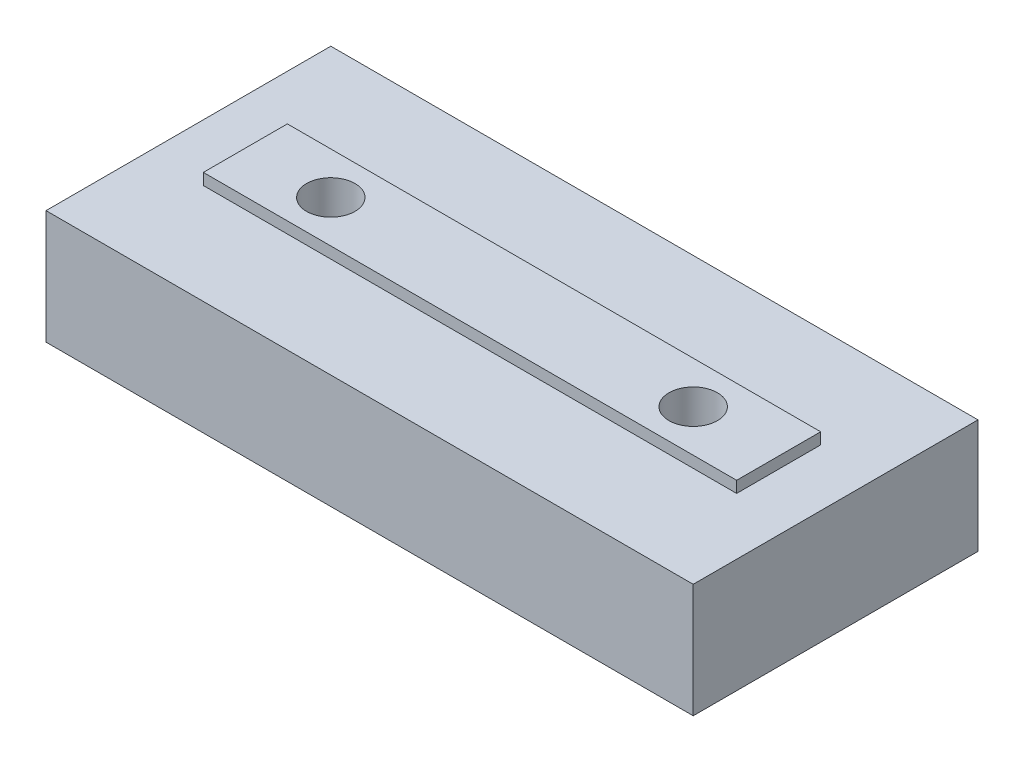
ISO-10303-21;
HEADER;
FILE_DESCRIPTION(('STEP AP214'),'2;1');
FILE_NAME('part.step','',(''),(''),'','','');
FILE_SCHEMA(('AUTOMOTIVE_DESIGN { 1 0 10303 214 1 1 1 1 }'));
ENDSEC;
DATA;
#1=APPLICATION_CONTEXT('core data for automotive mechanical design processes');
#2=APPLICATION_PROTOCOL_DEFINITION('international standard','automotive_design',2000,#1);
#3=PRODUCT_CONTEXT('',#1,'mechanical');
#4=PRODUCT('Part','Part','',(#3));
#5=PRODUCT_RELATED_PRODUCT_CATEGORY('part','',(#4));
#6=PRODUCT_DEFINITION_FORMATION('','',#4);
#7=PRODUCT_DEFINITION_CONTEXT('part definition',#1,'design');
#8=PRODUCT_DEFINITION('design','',#6,#7);
#9=PRODUCT_DEFINITION_SHAPE('','',#8);
#10=(LENGTH_UNIT() NAMED_UNIT(*) SI_UNIT(.MILLI.,.METRE.));
#11=(NAMED_UNIT(*) PLANE_ANGLE_UNIT() SI_UNIT($,.RADIAN.));
#12=(NAMED_UNIT(*) SI_UNIT($,.STERADIAN.) SOLID_ANGLE_UNIT());
#13=UNCERTAINTY_MEASURE_WITH_UNIT(LENGTH_MEASURE(1.E-05),#10,'distance_accuracy_value','');
#14=(GEOMETRIC_REPRESENTATION_CONTEXT(3) GLOBAL_UNCERTAINTY_ASSIGNED_CONTEXT((#13)) GLOBAL_UNIT_ASSIGNED_CONTEXT((#10,
#11,#12)) REPRESENTATION_CONTEXT('',''));
#15=CARTESIAN_POINT('',(0.,0.,0.));
#16=DIRECTION('',(0.,0.,1.));
#17=DIRECTION('',(1.,0.,0.));
#18=AXIS2_PLACEMENT_3D('',#15,#16,#17);
#19=CARTESIAN_POINT('',(-15.0702343832528,8.,-8.07629807039338));
#20=DIRECTION('',(1.,0.,0.));
#21=DIRECTION('',(0.,0.,-1.));
#22=AXIS2_PLACEMENT_3D('',#19,#20,#21);
#23=PLANE('',#22);
#24=DIRECTION('',(0.,0.,1.));
#25=VECTOR('',#24,1.);
#26=CARTESIAN_POINT('',(-15.0702343832528,0.,-8.07629807039338));
#27=LINE('',#26,#25);
#28=CARTESIAN_POINT('',(-15.0702343832528,0.,-8.07629807039338));
#29=VERTEX_POINT('',#28);
#30=CARTESIAN_POINT('',(-15.0702343832528,0.,11.9237019296066));
#31=VERTEX_POINT('',#30);
#32=EDGE_CURVE('E121',#29,#31,#27,.T.);
#33=ORIENTED_EDGE('',*,*,#32,.T.);
#34=DIRECTION('',(0.,-1.,0.));
#35=VECTOR('',#34,1.);
#36=CARTESIAN_POINT('',(-15.0702343832528,8.,11.9237019296066));
#37=LINE('',#36,#35);
#38=CARTESIAN_POINT('',(-15.0702343832528,8.,11.9237019296066));
#39=VERTEX_POINT('',#38);
#40=EDGE_CURVE('E11',#39,#31,#37,.T.);
#41=ORIENTED_EDGE('',*,*,#40,.F.);
#42=DIRECTION('',(0.,0.,1.));
#43=VECTOR('',#42,1.);
#44=CARTESIAN_POINT('',(-15.0702343832528,8.,-8.07629807039338));
#45=LINE('',#44,#43);
#46=CARTESIAN_POINT('',(-15.0702343832528,8.,-8.07629807039338));
#47=VERTEX_POINT('',#46);
#48=EDGE_CURVE('E130',#47,#39,#45,.T.);
#49=ORIENTED_EDGE('',*,*,#48,.F.);
#50=DIRECTION('',(0.,-1.,0.));
#51=VECTOR('',#50,1.);
#52=CARTESIAN_POINT('',(-15.0702343832528,8.,-8.07629807039338));
#53=LINE('',#52,#51);
#54=EDGE_CURVE('E141',#47,#29,#53,.T.);
#55=ORIENTED_EDGE('',*,*,#54,.T.);
#56=EDGE_LOOP('',(#33,#41,#49,#55));
#57=FACE_BOUND('',#56,.T.);
#58=ADVANCED_FACE('F36',(#57),#23,.F.);
#59=CARTESIAN_POINT('',(-15.0702343832528,8.,11.9237019296066));
#60=DIRECTION('',(0.,0.,-1.));
#61=DIRECTION('',(-1.,0.,0.));
#62=AXIS2_PLACEMENT_3D('',#59,#60,#61);
#63=PLANE('',#62);
#64=DIRECTION('',(1.,0.,0.));
#65=VECTOR('',#64,1.);
#66=CARTESIAN_POINT('',(-15.0702343832528,0.,11.9237019296066));
#67=LINE('',#66,#65);
#68=CARTESIAN_POINT('',(30.3797656167472,0.,11.9237019296066));
#69=VERTEX_POINT('',#68);
#70=EDGE_CURVE('E124',#31,#69,#67,.T.);
#71=ORIENTED_EDGE('',*,*,#70,.T.);
#72=DIRECTION('',(0.,-1.,0.));
#73=VECTOR('',#72,1.);
#74=CARTESIAN_POINT('',(30.3797656167472,8.,11.9237019296066));
#75=LINE('',#74,#73);
#76=CARTESIAN_POINT('',(30.3797656167472,8.,11.9237019296066));
#77=VERTEX_POINT('',#76);
#78=EDGE_CURVE('E43',#77,#69,#75,.T.);
#79=ORIENTED_EDGE('',*,*,#78,.F.);
#80=DIRECTION('',(1.,0.,0.));
#81=VECTOR('',#80,1.);
#82=CARTESIAN_POINT('',(-15.0702343832528,8.,11.9237019296066));
#83=LINE('',#82,#81);
#84=EDGE_CURVE('E133',#39,#77,#83,.T.);
#85=ORIENTED_EDGE('',*,*,#84,.F.);
#86=ORIENTED_EDGE('',*,*,#40,.T.);
#87=EDGE_LOOP('',(#71,#79,#85,#86));
#88=FACE_BOUND('',#87,.T.);
#89=ADVANCED_FACE('F158',(#88),#63,.F.);
#90=CARTESIAN_POINT('',(30.3797656167472,8.,-8.07629807039338));
#91=DIRECTION('',(1.,0.,0.));
#92=DIRECTION('',(0.,0.,-1.));
#93=AXIS2_PLACEMENT_3D('',#90,#91,#92);
#94=PLANE('',#93);
#95=DIRECTION('',(0.,0.,1.));
#96=VECTOR('',#95,1.);
#97=CARTESIAN_POINT('',(30.3797656167472,0.,-8.07629807039338));
#98=LINE('',#97,#96);
#99=CARTESIAN_POINT('',(30.3797656167472,0.,-8.07629807039338));
#100=VERTEX_POINT('',#99);
#101=EDGE_CURVE('E145',#100,#69,#98,.T.);
#102=ORIENTED_EDGE('',*,*,#101,.F.);
#103=DIRECTION('',(0.,-1.,0.));
#104=VECTOR('',#103,1.);
#105=CARTESIAN_POINT('',(30.3797656167472,8.,-8.07629807039338));
#106=LINE('',#105,#104);
#107=CARTESIAN_POINT('',(30.3797656167472,8.,-8.07629807039338));
#108=VERTEX_POINT('',#107);
#109=EDGE_CURVE('E151',#108,#100,#106,.T.);
#110=ORIENTED_EDGE('',*,*,#109,.F.);
#111=DIRECTION('',(0.,0.,1.));
#112=VECTOR('',#111,1.);
#113=CARTESIAN_POINT('',(30.3797656167472,8.,-8.07629807039338));
#114=LINE('',#113,#112);
#115=EDGE_CURVE('E136',#108,#77,#114,.T.);
#116=ORIENTED_EDGE('',*,*,#115,.T.);
#117=ORIENTED_EDGE('',*,*,#78,.T.);
#118=EDGE_LOOP('',(#102,#110,#116,#117));
#119=FACE_BOUND('',#118,.T.);
#120=ADVANCED_FACE('F155',(#119),#94,.T.);
#121=CARTESIAN_POINT('',(-15.0702343832528,8.,-8.07629807039338));
#122=DIRECTION('',(0.,0.,-1.));
#123=DIRECTION('',(-1.,0.,0.));
#124=AXIS2_PLACEMENT_3D('',#121,#122,#123);
#125=PLANE('',#124);
#126=DIRECTION('',(1.,0.,0.));
#127=VECTOR('',#126,1.);
#128=CARTESIAN_POINT('',(-15.0702343832528,0.,-8.07629807039338));
#129=LINE('',#128,#127);
#130=EDGE_CURVE('E134',#29,#100,#129,.T.);
#131=ORIENTED_EDGE('',*,*,#130,.F.);
#132=ORIENTED_EDGE('',*,*,#54,.F.);
#133=DIRECTION('',(1.,0.,0.));
#134=VECTOR('',#133,1.);
#135=CARTESIAN_POINT('',(-15.0702343832528,8.,-8.07629807039338));
#136=LINE('',#135,#134);
#137=EDGE_CURVE('E139',#47,#108,#136,.T.);
#138=ORIENTED_EDGE('',*,*,#137,.T.);
#139=ORIENTED_EDGE('',*,*,#109,.T.);
#140=EDGE_LOOP('',(#131,#132,#138,#139));
#141=FACE_BOUND('',#140,.T.);
#142=ADVANCED_FACE('F165',(#141),#125,.T.);
#143=CARTESIAN_POINT('',(0.,8.,0.));
#144=DIRECTION('',(0.,1.,0.));
#145=DIRECTION('',(0.,0.,1.));
#146=AXIS2_PLACEMENT_3D('',#143,#144,#145);
#147=PLANE('',#146);
#148=DIRECTION('',(0.,0.,1.));
#149=VECTOR('',#148,1.);
#150=CARTESIAN_POINT('',(-11.0702343832528,8.,-1.02629807039336));
#151=LINE('',#150,#149);
#152=CARTESIAN_POINT('',(-11.0702343832528,8.,-1.02629807039336));
#153=VERTEX_POINT('',#152);
#154=CARTESIAN_POINT('',(-11.0702343832528,8.,4.87370192960663));
#155=VERTEX_POINT('',#154);
#156=EDGE_CURVE('E50',#153,#155,#151,.T.);
#157=ORIENTED_EDGE('',*,*,#156,.F.);
#158=DIRECTION('',(1.,0.,0.));
#159=VECTOR('',#158,1.);
#160=CARTESIAN_POINT('',(-11.0702343832528,8.,-1.02629807039336));
#161=LINE('',#160,#159);
#162=CARTESIAN_POINT('',(26.3797656167472,8.,-1.02629807039336));
#163=VERTEX_POINT('',#162);
#164=EDGE_CURVE('E55',#153,#163,#161,.T.);
#165=ORIENTED_EDGE('',*,*,#164,.T.);
#166=DIRECTION('',(0.,0.,1.));
#167=VECTOR('',#166,1.);
#168=CARTESIAN_POINT('',(26.3797656167472,8.,-1.02629807039336));
#169=LINE('',#168,#167);
#170=CARTESIAN_POINT('',(26.3797656167472,8.,4.87370192960663));
#171=VERTEX_POINT('',#170);
#172=EDGE_CURVE('E233',#163,#171,#169,.T.);
#173=ORIENTED_EDGE('',*,*,#172,.T.);
#174=DIRECTION('',(1.,0.,0.));
#175=VECTOR('',#174,1.);
#176=CARTESIAN_POINT('',(-11.0702343832528,8.,4.87370192960663));
#177=LINE('',#176,#175);
#178=EDGE_CURVE('E231',#155,#171,#177,.T.);
#179=ORIENTED_EDGE('',*,*,#178,.F.);
#180=EDGE_LOOP('',(#157,#165,#173,#179));
#181=FACE_BOUND('',#180,.T.);
#182=ORIENTED_EDGE('',*,*,#48,.T.);
#183=ORIENTED_EDGE('',*,*,#84,.T.);
#184=ORIENTED_EDGE('',*,*,#115,.F.);
#185=ORIENTED_EDGE('',*,*,#137,.F.);
#186=EDGE_LOOP('',(#182,#183,#184,#185));
#187=FACE_BOUND('',#186,.T.);
#188=ADVANCED_FACE('F169',(#181,#187),#147,.T.);
#189=CARTESIAN_POINT('',(0.,0.,0.));
#190=DIRECTION('',(0.,1.,0.));
#191=DIRECTION('',(0.,0.,1.));
#192=AXIS2_PLACEMENT_3D('',#189,#190,#191);
#193=PLANE('',#192);
#194=CARTESIAN_POINT('',(20.3797656167472,0.,1.92370192960662));
#195=DIRECTION('',(0.,-1.,0.));
#196=DIRECTION('',(0.,0.,-1.));
#197=AXIS2_PLACEMENT_3D('',#194,#195,#196);
#198=CIRCLE('',#197,1.7);
#199=CARTESIAN_POINT('',(20.3797656167472,0.,0.223701929606626));
#200=VERTEX_POINT('',#199);
#201=EDGE_CURVE('E217',#200,#200,#198,.T.);
#202=ORIENTED_EDGE('',*,*,#201,.F.);
#203=EDGE_LOOP('',(#202));
#204=FACE_BOUND('',#203,.T.);
#205=CARTESIAN_POINT('',(-5.07023438325283,0.,1.92370192960662));
#206=DIRECTION('',(0.,-1.,0.));
#207=DIRECTION('',(0.,0.,-1.));
#208=AXIS2_PLACEMENT_3D('',#205,#206,#207);
#209=CIRCLE('',#208,1.7);
#210=CARTESIAN_POINT('',(-5.07023438325283,0.,0.223701929606625));
#211=VERTEX_POINT('',#210);
#212=EDGE_CURVE('E219',#211,#211,#209,.T.);
#213=ORIENTED_EDGE('',*,*,#212,.F.);
#214=EDGE_LOOP('',(#213));
#215=FACE_BOUND('',#214,.T.);
#216=ORIENTED_EDGE('',*,*,#32,.F.);
#217=ORIENTED_EDGE('',*,*,#130,.T.);
#218=ORIENTED_EDGE('',*,*,#101,.T.);
#219=ORIENTED_EDGE('',*,*,#70,.F.);
#220=EDGE_LOOP('',(#216,#217,#218,#219));
#221=FACE_BOUND('',#220,.T.);
#222=ADVANCED_FACE('F162',(#204,#215,#221),#193,.F.);
#223=CARTESIAN_POINT('',(-11.0702343832528,8.8,-1.02629807039336));
#224=DIRECTION('',(1.,0.,0.));
#225=DIRECTION('',(0.,0.,-1.));
#226=AXIS2_PLACEMENT_3D('',#223,#224,#225);
#227=PLANE('',#226);
#228=ORIENTED_EDGE('',*,*,#156,.T.);
#229=DIRECTION('',(0.,-1.,0.));
#230=VECTOR('',#229,1.);
#231=CARTESIAN_POINT('',(-11.0702343832528,8.8,4.87370192960663));
#232=LINE('',#231,#230);
#233=CARTESIAN_POINT('',(-11.0702343832528,8.8,4.87370192960663));
#234=VERTEX_POINT('',#233);
#235=EDGE_CURVE('E104',#234,#155,#232,.T.);
#236=ORIENTED_EDGE('',*,*,#235,.F.);
#237=DIRECTION('',(0.,0.,1.));
#238=VECTOR('',#237,1.);
#239=CARTESIAN_POINT('',(-11.0702343832528,8.8,-1.02629807039336));
#240=LINE('',#239,#238);
#241=CARTESIAN_POINT('',(-11.0702343832528,8.8,-1.02629807039336));
#242=VERTEX_POINT('',#241);
#243=EDGE_CURVE('E111',#242,#234,#240,.T.);
#244=ORIENTED_EDGE('',*,*,#243,.F.);
#245=DIRECTION('',(0.,-1.,0.));
#246=VECTOR('',#245,1.);
#247=CARTESIAN_POINT('',(-11.0702343832528,8.8,-1.02629807039336));
#248=LINE('',#247,#246);
#249=EDGE_CURVE('E229',#242,#153,#248,.T.);
#250=ORIENTED_EDGE('',*,*,#249,.T.);
#251=EDGE_LOOP('',(#228,#236,#244,#250));
#252=FACE_BOUND('',#251,.T.);
#253=ADVANCED_FACE('F120',(#252),#227,.F.);
#254=CARTESIAN_POINT('',(-11.0702343832528,8.8,4.87370192960663));
#255=DIRECTION('',(0.,0.,-1.));
#256=DIRECTION('',(-1.,0.,0.));
#257=AXIS2_PLACEMENT_3D('',#254,#255,#256);
#258=PLANE('',#257);
#259=ORIENTED_EDGE('',*,*,#178,.T.);
#260=DIRECTION('',(0.,-1.,0.));
#261=VECTOR('',#260,1.);
#262=CARTESIAN_POINT('',(26.3797656167472,8.8,4.87370192960663));
#263=LINE('',#262,#261);
#264=CARTESIAN_POINT('',(26.3797656167472,8.8,4.87370192960663));
#265=VERTEX_POINT('',#264);
#266=EDGE_CURVE('E106',#265,#171,#263,.T.);
#267=ORIENTED_EDGE('',*,*,#266,.F.);
#268=DIRECTION('',(1.,0.,0.));
#269=VECTOR('',#268,1.);
#270=CARTESIAN_POINT('',(-11.0702343832528,8.8,4.87370192960663));
#271=LINE('',#270,#269);
#272=EDGE_CURVE('E99',#234,#265,#271,.T.);
#273=ORIENTED_EDGE('',*,*,#272,.F.);
#274=ORIENTED_EDGE('',*,*,#235,.T.);
#275=EDGE_LOOP('',(#259,#267,#273,#274));
#276=FACE_BOUND('',#275,.T.);
#277=ADVANCED_FACE('F102',(#276),#258,.F.);
#278=CARTESIAN_POINT('',(26.3797656167472,8.8,-1.02629807039336));
#279=DIRECTION('',(1.,0.,0.));
#280=DIRECTION('',(0.,0.,-1.));
#281=AXIS2_PLACEMENT_3D('',#278,#279,#280);
#282=PLANE('',#281);
#283=ORIENTED_EDGE('',*,*,#172,.F.);
#284=DIRECTION('',(0.,-1.,0.));
#285=VECTOR('',#284,1.);
#286=CARTESIAN_POINT('',(26.3797656167472,8.8,-1.02629807039336));
#287=LINE('',#286,#285);
#288=CARTESIAN_POINT('',(26.3797656167472,8.8,-1.02629807039336));
#289=VERTEX_POINT('',#288);
#290=EDGE_CURVE('E126',#289,#163,#287,.T.);
#291=ORIENTED_EDGE('',*,*,#290,.F.);
#292=DIRECTION('',(0.,0.,1.));
#293=VECTOR('',#292,1.);
#294=CARTESIAN_POINT('',(26.3797656167472,8.8,-1.02629807039336));
#295=LINE('',#294,#293);
#296=EDGE_CURVE('E110',#289,#265,#295,.T.);
#297=ORIENTED_EDGE('',*,*,#296,.T.);
#298=ORIENTED_EDGE('',*,*,#266,.T.);
#299=EDGE_LOOP('',(#283,#291,#297,#298));
#300=FACE_BOUND('',#299,.T.);
#301=ADVANCED_FACE('F191',(#300),#282,.T.);
#302=CARTESIAN_POINT('',(-11.0702343832528,8.8,-1.02629807039336));
#303=DIRECTION('',(0.,0.,-1.));
#304=DIRECTION('',(-1.,0.,0.));
#305=AXIS2_PLACEMENT_3D('',#302,#303,#304);
#306=PLANE('',#305);
#307=ORIENTED_EDGE('',*,*,#164,.F.);
#308=ORIENTED_EDGE('',*,*,#249,.F.);
#309=DIRECTION('',(1.,0.,0.));
#310=VECTOR('',#309,1.);
#311=CARTESIAN_POINT('',(-11.0702343832528,8.8,-1.02629807039336));
#312=LINE('',#311,#310);
#313=EDGE_CURVE('E117',#242,#289,#312,.T.);
#314=ORIENTED_EDGE('',*,*,#313,.T.);
#315=ORIENTED_EDGE('',*,*,#290,.T.);
#316=EDGE_LOOP('',(#307,#308,#314,#315));
#317=FACE_BOUND('',#316,.T.);
#318=ADVANCED_FACE('F194',(#317),#306,.T.);
#319=CARTESIAN_POINT('',(0.,8.8,0.));
#320=DIRECTION('',(0.,1.,0.));
#321=DIRECTION('',(0.,0.,1.));
#322=AXIS2_PLACEMENT_3D('',#319,#320,#321);
#323=PLANE('',#322);
#324=CARTESIAN_POINT('',(20.3797656167472,8.8,1.92370192960662));
#325=DIRECTION('',(0.,-1.,0.));
#326=DIRECTION('',(0.,0.,-1.));
#327=AXIS2_PLACEMENT_3D('',#324,#325,#326);
#328=CIRCLE('',#327,1.7);
#329=CARTESIAN_POINT('',(20.3797656167472,8.8,0.223701929606626));
#330=VERTEX_POINT('',#329);
#331=EDGE_CURVE('E214',#330,#330,#328,.T.);
#332=ORIENTED_EDGE('',*,*,#331,.T.);
#333=EDGE_LOOP('',(#332));
#334=FACE_BOUND('',#333,.T.);
#335=CARTESIAN_POINT('',(-5.07023438325283,8.8,1.92370192960662));
#336=DIRECTION('',(0.,-1.,0.));
#337=DIRECTION('',(0.,0.,-1.));
#338=AXIS2_PLACEMENT_3D('',#335,#336,#337);
#339=CIRCLE('',#338,1.7);
#340=CARTESIAN_POINT('',(-5.07023438325283,8.8,0.223701929606625));
#341=VERTEX_POINT('',#340);
#342=EDGE_CURVE('E224',#341,#341,#339,.T.);
#343=ORIENTED_EDGE('',*,*,#342,.T.);
#344=EDGE_LOOP('',(#343));
#345=FACE_BOUND('',#344,.T.);
#346=ORIENTED_EDGE('',*,*,#243,.T.);
#347=ORIENTED_EDGE('',*,*,#272,.T.);
#348=ORIENTED_EDGE('',*,*,#296,.F.);
#349=ORIENTED_EDGE('',*,*,#313,.F.);
#350=EDGE_LOOP('',(#346,#347,#348,#349));
#351=FACE_BOUND('',#350,.T.);
#352=ADVANCED_FACE('F115',(#334,#345,#351),#323,.T.);
#353=CARTESIAN_POINT('',(-5.07023438325283,0.,1.92370192960662));
#354=DIRECTION('',(0.,-1.,0.));
#355=DIRECTION('',(0.,0.,-1.));
#356=AXIS2_PLACEMENT_3D('',#353,#354,#355);
#357=CYLINDRICAL_SURFACE('',#356,1.7);
#358=ORIENTED_EDGE('',*,*,#342,.F.);
#359=EDGE_LOOP('',(#358));
#360=FACE_BOUND('',#359,.T.);
#361=ORIENTED_EDGE('',*,*,#212,.T.);
#362=EDGE_LOOP('',(#361));
#363=FACE_BOUND('',#362,.T.);
#364=ADVANCED_FACE('F201',(#360,#363),#357,.F.);
#365=CARTESIAN_POINT('',(20.3797656167472,0.,1.92370192960662));
#366=DIRECTION('',(0.,-1.,0.));
#367=DIRECTION('',(0.,0.,-1.));
#368=AXIS2_PLACEMENT_3D('',#365,#366,#367);
#369=CYLINDRICAL_SURFACE('',#368,1.7);
#370=ORIENTED_EDGE('',*,*,#331,.F.);
#371=EDGE_LOOP('',(#370));
#372=FACE_BOUND('',#371,.T.);
#373=ORIENTED_EDGE('',*,*,#201,.T.);
#374=EDGE_LOOP('',(#373));
#375=FACE_BOUND('',#374,.T.);
#376=ADVANCED_FACE('F205',(#372,#375),#369,.F.);
#377=CLOSED_SHELL('',(#58,#89,#120,#142,#188,#222,#253,#277,#301,#318,#352,#364,#376));
#378=MANIFOLD_SOLID_BREP('B2',#377);
#379=ADVANCED_BREP_SHAPE_REPRESENTATION('',(#18,#378),#14);
#380=SHAPE_DEFINITION_REPRESENTATION(#9,#379);
ENDSEC;
END-ISO-10303-21;
